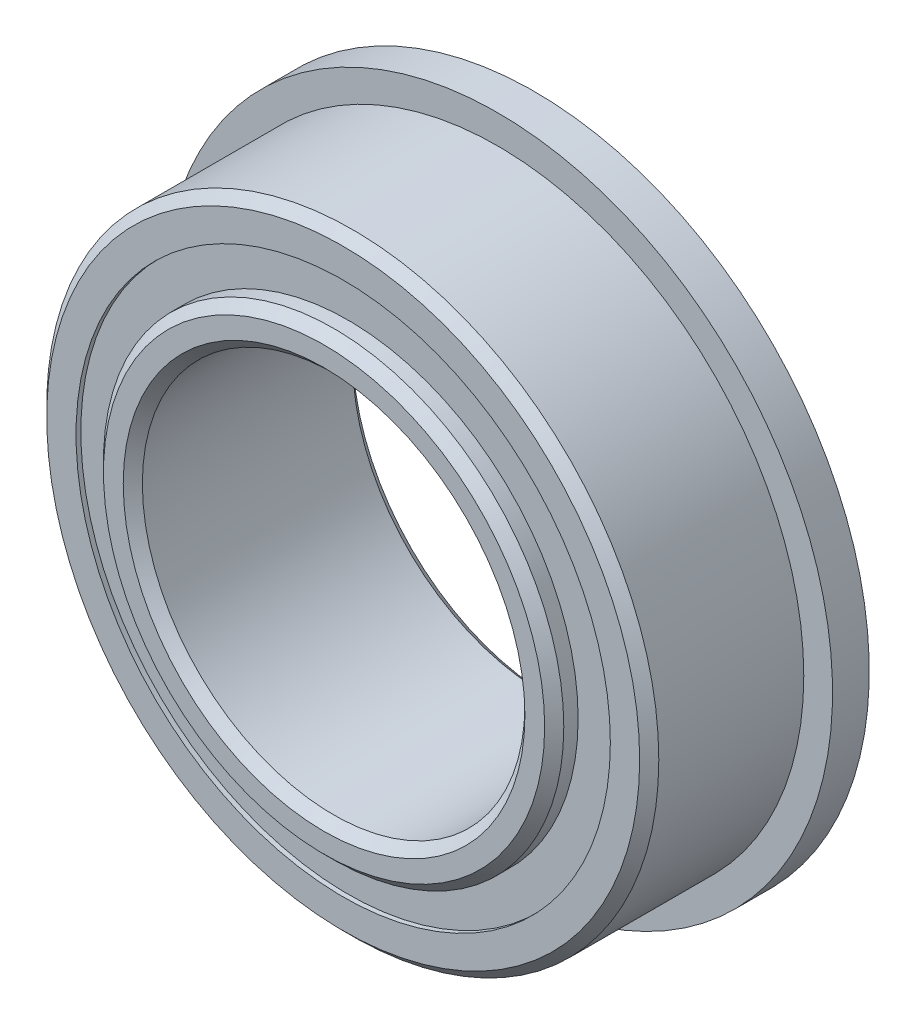
ISO-10303-21;
HEADER;
FILE_DESCRIPTION(('STEP AP214'),'2;1');
FILE_NAME('part.step','',(''),(''),'','','');
FILE_SCHEMA(('AUTOMOTIVE_DESIGN { 1 0 10303 214 1 1 1 1 }'));
ENDSEC;
DATA;
#1=APPLICATION_CONTEXT('core data for automotive mechanical design processes');
#2=APPLICATION_PROTOCOL_DEFINITION('international standard','automotive_design',2000,#1);
#3=PRODUCT_CONTEXT('',#1,'mechanical');
#4=PRODUCT('Part','Part','',(#3));
#5=PRODUCT_RELATED_PRODUCT_CATEGORY('part','',(#4));
#6=PRODUCT_DEFINITION_FORMATION('','',#4);
#7=PRODUCT_DEFINITION_CONTEXT('part definition',#1,'design');
#8=PRODUCT_DEFINITION('design','',#6,#7);
#9=PRODUCT_DEFINITION_SHAPE('','',#8);
#10=(LENGTH_UNIT() NAMED_UNIT(*) SI_UNIT(.MILLI.,.METRE.));
#11=(NAMED_UNIT(*) PLANE_ANGLE_UNIT() SI_UNIT($,.RADIAN.));
#12=(NAMED_UNIT(*) SI_UNIT($,.STERADIAN.) SOLID_ANGLE_UNIT());
#13=UNCERTAINTY_MEASURE_WITH_UNIT(LENGTH_MEASURE(1.E-05),#10,'distance_accuracy_value','');
#14=(GEOMETRIC_REPRESENTATION_CONTEXT(3) GLOBAL_UNCERTAINTY_ASSIGNED_CONTEXT((#13)) GLOBAL_UNIT_ASSIGNED_CONTEXT((#10,
#11,#12)) REPRESENTATION_CONTEXT('',''));
#15=CARTESIAN_POINT('',(0.,0.,0.));
#16=DIRECTION('',(0.,0.,1.));
#17=DIRECTION('',(1.,0.,0.));
#18=AXIS2_PLACEMENT_3D('',#15,#16,#17);
#19=CARTESIAN_POINT('',(0.,5.54316620879121,-1.88515625));
#20=DIRECTION('',(0.,0.,1.));
#21=DIRECTION('',(1.,0.,0.));
#22=AXIS2_PLACEMENT_3D('',#19,#20,#21);
#23=PLANE('',#22);
#24=CARTESIAN_POINT('',(0.,0.,-1.88515625));
#25=DIRECTION('',(0.,0.,1.));
#26=DIRECTION('',(1.,0.,0.));
#27=AXIS2_PLACEMENT_3D('',#24,#25,#26);
#28=CIRCLE('',#27,5.54316620879121);
#29=CARTESIAN_POINT('',(5.54316620879121,0.,-1.88515625));
#30=VERTEX_POINT('',#29);
#31=EDGE_CURVE('E55',#30,#30,#28,.T.);
#32=ORIENTED_EDGE('',*,*,#31,.F.);
#33=EDGE_LOOP('',(#32));
#34=FACE_BOUND('',#33,.T.);
#35=CARTESIAN_POINT('',(0.,0.,-1.88515625));
#36=DIRECTION('',(0.,0.,1.));
#37=DIRECTION('',(1.,0.,0.));
#38=AXIS2_PLACEMENT_3D('',#35,#36,#37);
#39=CIRCLE('',#38,4.77558379120879);
#40=CARTESIAN_POINT('',(4.77558379120879,0.,-1.88515625));
#41=VERTEX_POINT('',#40);
#42=EDGE_CURVE('E11',#41,#41,#39,.T.);
#43=ORIENTED_EDGE('',*,*,#42,.T.);
#44=EDGE_LOOP('',(#43));
#45=FACE_BOUND('',#44,.T.);
#46=ADVANCED_FACE('F41',(#34,#45),#23,.F.);
#47=CARTESIAN_POINT('',(0.,0.,1.984375));
#48=DIRECTION('',(0.,0.,1.));
#49=DIRECTION('',(1.,0.,0.));
#50=AXIS2_PLACEMENT_3D('',#47,#48,#49);
#51=CYLINDRICAL_SURFACE('',#50,4.77558379120879);
#52=ORIENTED_EDGE('',*,*,#42,.F.);
#53=EDGE_LOOP('',(#52));
#54=FACE_BOUND('',#53,.T.);
#55=CARTESIAN_POINT('',(0.,0.,-0.961832467237324));
#56=DIRECTION('',(0.,0.,1.));
#57=DIRECTION('',(1.,0.,0.));
#58=AXIS2_PLACEMENT_3D('',#55,#56,#57);
#59=CIRCLE('',#58,4.77558379120879);
#60=CARTESIAN_POINT('',(4.77558379120879,0.,-0.961832467237324));
#61=VERTEX_POINT('',#60);
#62=EDGE_CURVE('E47',#61,#61,#59,.T.);
#63=ORIENTED_EDGE('',*,*,#62,.T.);
#64=EDGE_LOOP('',(#63));
#65=FACE_BOUND('',#64,.T.);
#66=ADVANCED_FACE('F64',(#54,#65),#51,.F.);
#67=CARTESIAN_POINT('',(0.,5.54316620879121,-0.961832467237324));
#68=DIRECTION('',(0.,0.,-1.));
#69=DIRECTION('',(-1.,0.,0.));
#70=AXIS2_PLACEMENT_3D('',#67,#68,#69);
#71=PLANE('',#70);
#72=ORIENTED_EDGE('',*,*,#62,.F.);
#73=EDGE_LOOP('',(#72));
#74=FACE_BOUND('',#73,.T.);
#75=CARTESIAN_POINT('',(0.,0.,-0.961832467237324));
#76=DIRECTION('',(0.,0.,1.));
#77=DIRECTION('',(1.,0.,0.));
#78=AXIS2_PLACEMENT_3D('',#75,#76,#77);
#79=CIRCLE('',#78,5.54316620879121);
#80=CARTESIAN_POINT('',(5.54316620879121,0.,-0.961832467237324));
#81=VERTEX_POINT('',#80);
#82=EDGE_CURVE('E51',#81,#81,#79,.T.);
#83=ORIENTED_EDGE('',*,*,#82,.T.);
#84=EDGE_LOOP('',(#83));
#85=FACE_BOUND('',#84,.T.);
#86=ADVANCED_FACE('F68',(#74,#85),#71,.F.);
#87=CARTESIAN_POINT('',(0.,0.,1.984375));
#88=DIRECTION('',(0.,0.,1.));
#89=DIRECTION('',(1.,0.,0.));
#90=AXIS2_PLACEMENT_3D('',#87,#88,#89);
#91=CYLINDRICAL_SURFACE('',#90,5.54316620879121);
#92=ORIENTED_EDGE('',*,*,#82,.F.);
#93=EDGE_LOOP('',(#92));
#94=FACE_BOUND('',#93,.T.);
#95=ORIENTED_EDGE('',*,*,#31,.T.);
#96=EDGE_LOOP('',(#95));
#97=FACE_BOUND('',#96,.T.);
#98=ADVANCED_FACE('F61',(#94,#97),#91,.T.);
#99=CLOSED_SHELL('',(#46,#66,#86,#98));
#100=MANIFOLD_SOLID_BREP('B2',#99);
#101=CARTESIAN_POINT('',(0.,5.54316620879121,1.88515625));
#102=DIRECTION('',(0.,0.,-1.));
#103=DIRECTION('',(-1.,0.,0.));
#104=AXIS2_PLACEMENT_3D('',#101,#102,#103);
#105=PLANE('',#104);
#106=CARTESIAN_POINT('',(0.,0.,1.88515625));
#107=DIRECTION('',(0.,0.,1.));
#108=DIRECTION('',(1.,0.,0.));
#109=AXIS2_PLACEMENT_3D('',#106,#107,#108);
#110=CIRCLE('',#109,4.77558379120879);
#111=CARTESIAN_POINT('',(4.77558379120879,0.,1.88515625));
#112=VERTEX_POINT('',#111);
#113=EDGE_CURVE('E40',#112,#112,#110,.T.);
#114=ORIENTED_EDGE('',*,*,#113,.F.);
#115=EDGE_LOOP('',(#114));
#116=FACE_BOUND('',#115,.T.);
#117=CARTESIAN_POINT('',(0.,0.,1.88515625));
#118=DIRECTION('',(0.,0.,1.));
#119=DIRECTION('',(1.,0.,0.));
#120=AXIS2_PLACEMENT_3D('',#117,#118,#119);
#121=CIRCLE('',#120,5.54316620879121);
#122=CARTESIAN_POINT('',(5.54316620879121,0.,1.88515625));
#123=VERTEX_POINT('',#122);
#124=EDGE_CURVE('E122',#123,#123,#121,.T.);
#125=ORIENTED_EDGE('',*,*,#124,.T.);
#126=EDGE_LOOP('',(#125));
#127=FACE_BOUND('',#126,.T.);
#128=ADVANCED_FACE('F108',(#116,#127),#105,.F.);
#129=CARTESIAN_POINT('',(0.,0.,1.984375));
#130=DIRECTION('',(0.,0.,1.));
#131=DIRECTION('',(1.,0.,0.));
#132=AXIS2_PLACEMENT_3D('',#129,#130,#131);
#133=CYLINDRICAL_SURFACE('',#132,4.77558379120879);
#134=CARTESIAN_POINT('',(0.,0.,0.961832467237323));
#135=DIRECTION('',(0.,0.,1.));
#136=DIRECTION('',(1.,0.,0.));
#137=AXIS2_PLACEMENT_3D('',#134,#135,#136);
#138=CIRCLE('',#137,4.77558379120879);
#139=CARTESIAN_POINT('',(4.77558379120879,0.,0.961832467237323));
#140=VERTEX_POINT('',#139);
#141=EDGE_CURVE('E114',#140,#140,#138,.T.);
#142=ORIENTED_EDGE('',*,*,#141,.F.);
#143=EDGE_LOOP('',(#142));
#144=FACE_BOUND('',#143,.T.);
#145=ORIENTED_EDGE('',*,*,#113,.T.);
#146=EDGE_LOOP('',(#145));
#147=FACE_BOUND('',#146,.T.);
#148=ADVANCED_FACE('F137',(#144,#147),#133,.F.);
#149=CARTESIAN_POINT('',(0.,5.54316620879121,0.961832467237323));
#150=DIRECTION('',(0.,0.,1.));
#151=DIRECTION('',(1.,0.,0.));
#152=AXIS2_PLACEMENT_3D('',#149,#150,#151);
#153=PLANE('',#152);
#154=CARTESIAN_POINT('',(0.,0.,0.961832467237323));
#155=DIRECTION('',(0.,0.,1.));
#156=DIRECTION('',(1.,0.,0.));
#157=AXIS2_PLACEMENT_3D('',#154,#155,#156);
#158=CIRCLE('',#157,5.54316620879121);
#159=CARTESIAN_POINT('',(5.54316620879121,0.,0.961832467237323));
#160=VERTEX_POINT('',#159);
#161=EDGE_CURVE('E118',#160,#160,#158,.T.);
#162=ORIENTED_EDGE('',*,*,#161,.F.);
#163=EDGE_LOOP('',(#162));
#164=FACE_BOUND('',#163,.T.);
#165=ORIENTED_EDGE('',*,*,#141,.T.);
#166=EDGE_LOOP('',(#165));
#167=FACE_BOUND('',#166,.T.);
#168=ADVANCED_FACE('F132',(#164,#167),#153,.F.);
#169=CARTESIAN_POINT('',(0.,0.,1.984375));
#170=DIRECTION('',(0.,0.,1.));
#171=DIRECTION('',(1.,0.,0.));
#172=AXIS2_PLACEMENT_3D('',#169,#170,#171);
#173=CYLINDRICAL_SURFACE('',#172,5.54316620879121);
#174=ORIENTED_EDGE('',*,*,#124,.F.);
#175=EDGE_LOOP('',(#174));
#176=FACE_BOUND('',#175,.T.);
#177=ORIENTED_EDGE('',*,*,#161,.T.);
#178=EDGE_LOOP('',(#177));
#179=FACE_BOUND('',#178,.T.);
#180=ADVANCED_FACE('F129',(#176,#179),#173,.T.);
#181=CLOSED_SHELL('',(#128,#148,#168,#180));
#182=MANIFOLD_SOLID_BREP('B6',#181);
#183=CARTESIAN_POINT('',(-2.57968749999994,4.46814981765037,0.));
#184=DIRECTION('',(0.,0.,1.));
#185=DIRECTION('',(0.499999999999989,-0.866025403784445,0.));
#186=AXIS2_PLACEMENT_3D('',#183,#184,#185);
#187=SPHERICAL_SURFACE('',#186,0.961832467237323);
#188=CARTESIAN_POINT('',(-2.57968749999994,4.46814981765037,0.961832467237323));
#189=VERTEX_POINT('',#188);
#190=VERTEX_LOOP('',#189);
#191=FACE_BOUND('',#190,.T.);
#192=ADVANCED_FACE('F175',(#191),#187,.T.);
#193=CLOSED_SHELL('',(#192));
#194=MANIFOLD_SOLID_BREP('B35',#193);
#195=CARTESIAN_POINT('',(-4.46814981765031,2.57968750000005,0.));
#196=DIRECTION('',(0.,0.,1.));
#197=DIRECTION('',(0.866025403784433,-0.50000000000001,0.));
#198=AXIS2_PLACEMENT_3D('',#195,#196,#197);
#199=SPHERICAL_SURFACE('',#198,0.961832467237323);
#200=CARTESIAN_POINT('',(-4.46814981765031,2.57968750000005,0.961832467237323));
#201=VERTEX_POINT('',#200);
#202=VERTEX_LOOP('',#201);
#203=FACE_BOUND('',#202,.T.);
#204=ADVANCED_FACE('F195',(#203),#199,.T.);
#205=CLOSED_SHELL('',(#204));
#206=MANIFOLD_SOLID_BREP('B104',#205);
#207=CARTESIAN_POINT('',(-5.159375,0.,0.));
#208=DIRECTION('',(0.,0.,1.));
#209=DIRECTION('',(1.,0.,0.));
#210=AXIS2_PLACEMENT_3D('',#207,#208,#209);
#211=SPHERICAL_SURFACE('',#210,0.961832467237323);
#212=CARTESIAN_POINT('',(-5.159375,0.,0.961832467237323));
#213=VERTEX_POINT('',#212);
#214=VERTEX_LOOP('',#213);
#215=FACE_BOUND('',#214,.T.);
#216=ADVANCED_FACE('F215',(#215),#211,.T.);
#217=CLOSED_SHELL('',(#216));
#218=MANIFOLD_SOLID_BREP('B171',#217);
#219=CARTESIAN_POINT('',(-4.46814981765036,-2.57968749999996,0.));
#220=DIRECTION('',(0.,0.,1.));
#221=DIRECTION('',(0.866025403784443,0.499999999999992,0.));
#222=AXIS2_PLACEMENT_3D('',#219,#220,#221);
#223=SPHERICAL_SURFACE('',#222,0.961832467237323);
#224=CARTESIAN_POINT('',(-4.46814981765036,-2.57968749999996,0.961832467237323));
#225=VERTEX_POINT('',#224);
#226=VERTEX_LOOP('',#225);
#227=FACE_BOUND('',#226,.T.);
#228=ADVANCED_FACE('F235',(#227),#223,.T.);
#229=CLOSED_SHELL('',(#228));
#230=MANIFOLD_SOLID_BREP('B191',#229);
#231=CARTESIAN_POINT('',(-2.57968750000004,-4.46814981765032,0.));
#232=DIRECTION('',(0.,0.,1.));
#233=DIRECTION('',(0.500000000000007,0.866025403784435,0.));
#234=AXIS2_PLACEMENT_3D('',#231,#232,#233);
#235=SPHERICAL_SURFACE('',#234,0.961832467237323);
#236=CARTESIAN_POINT('',(-2.57968750000004,-4.46814981765032,0.961832467237323));
#237=VERTEX_POINT('',#236);
#238=VERTEX_LOOP('',#237);
#239=FACE_BOUND('',#238,.T.);
#240=ADVANCED_FACE('F255',(#239),#235,.T.);
#241=CLOSED_SHELL('',(#240));
#242=MANIFOLD_SOLID_BREP('B211',#241);
#243=CARTESIAN_POINT('',(0.,-5.159375,0.));
#244=DIRECTION('',(0.,0.,1.));
#245=DIRECTION('',(0.,1.,0.));
#246=AXIS2_PLACEMENT_3D('',#243,#244,#245);
#247=SPHERICAL_SURFACE('',#246,0.961832467237323);
#248=CARTESIAN_POINT('',(0.,-5.159375,0.961832467237323));
#249=VERTEX_POINT('',#248);
#250=VERTEX_LOOP('',#249);
#251=FACE_BOUND('',#250,.T.);
#252=ADVANCED_FACE('F275',(#251),#247,.T.);
#253=CLOSED_SHELL('',(#252));
#254=MANIFOLD_SOLID_BREP('B231',#253);
#255=CARTESIAN_POINT('',(2.57968749999997,-4.46814981765035,0.));
#256=DIRECTION('',(0.,0.,1.));
#257=DIRECTION('',(-0.499999999999995,0.866025403784442,0.));
#258=AXIS2_PLACEMENT_3D('',#255,#256,#257);
#259=SPHERICAL_SURFACE('',#258,0.961832467237323);
#260=CARTESIAN_POINT('',(2.57968749999997,-4.46814981765035,0.961832467237323));
#261=VERTEX_POINT('',#260);
#262=VERTEX_LOOP('',#261);
#263=FACE_BOUND('',#262,.T.);
#264=ADVANCED_FACE('F295',(#263),#259,.T.);
#265=CLOSED_SHELL('',(#264));
#266=MANIFOLD_SOLID_BREP('B251',#265);
#267=CARTESIAN_POINT('',(4.46814981765033,-2.57968750000002,0.));
#268=DIRECTION('',(0.,0.,1.));
#269=DIRECTION('',(-0.866025403784436,0.500000000000004,0.));
#270=AXIS2_PLACEMENT_3D('',#267,#268,#269);
#271=SPHERICAL_SURFACE('',#270,0.961832467237323);
#272=CARTESIAN_POINT('',(4.46814981765033,-2.57968750000002,0.961832467237323));
#273=VERTEX_POINT('',#272);
#274=VERTEX_LOOP('',#273);
#275=FACE_BOUND('',#274,.T.);
#276=ADVANCED_FACE('F315',(#275),#271,.T.);
#277=CLOSED_SHELL('',(#276));
#278=MANIFOLD_SOLID_BREP('B271',#277);
#279=CARTESIAN_POINT('',(5.159375,0.,0.));
#280=DIRECTION('',(0.,0.,1.));
#281=DIRECTION('',(-1.,0.,0.));
#282=AXIS2_PLACEMENT_3D('',#279,#280,#281);
#283=SPHERICAL_SURFACE('',#282,0.961832467237323);
#284=CARTESIAN_POINT('',(5.159375,0.,0.961832467237323));
#285=VERTEX_POINT('',#284);
#286=VERTEX_LOOP('',#285);
#287=FACE_BOUND('',#286,.T.);
#288=ADVANCED_FACE('F335',(#287),#283,.T.);
#289=CLOSED_SHELL('',(#288));
#290=MANIFOLD_SOLID_BREP('B291',#289);
#291=CARTESIAN_POINT('',(4.46814981765034,2.57968749999999,0.));
#292=DIRECTION('',(0.,0.,1.));
#293=DIRECTION('',(-0.86602540378444,-0.499999999999998,0.));
#294=AXIS2_PLACEMENT_3D('',#291,#292,#293);
#295=SPHERICAL_SURFACE('',#294,0.961832467237323);
#296=CARTESIAN_POINT('',(4.46814981765034,2.57968749999999,0.961832467237323));
#297=VERTEX_POINT('',#296);
#298=VERTEX_LOOP('',#297);
#299=FACE_BOUND('',#298,.T.);
#300=ADVANCED_FACE('F355',(#299),#295,.T.);
#301=CLOSED_SHELL('',(#300));
#302=MANIFOLD_SOLID_BREP('B311',#301);
#303=CARTESIAN_POINT('',(2.57968750000001,4.46814981765033,0.));
#304=DIRECTION('',(0.,0.,1.));
#305=DIRECTION('',(-0.500000000000001,-0.866025403784438,0.));
#306=AXIS2_PLACEMENT_3D('',#303,#304,#305);
#307=SPHERICAL_SURFACE('',#306,0.961832467237323);
#308=CARTESIAN_POINT('',(2.57968750000001,4.46814981765033,0.961832467237323));
#309=VERTEX_POINT('',#308);
#310=VERTEX_LOOP('',#309);
#311=FACE_BOUND('',#310,.T.);
#312=ADVANCED_FACE('F375',(#311),#307,.T.);
#313=CLOSED_SHELL('',(#312));
#314=MANIFOLD_SOLID_BREP('B331',#313);
#315=CARTESIAN_POINT('',(0.,5.159375,0.));
#316=DIRECTION('',(0.,0.,1.));
#317=DIRECTION('',(0.,-1.,0.));
#318=AXIS2_PLACEMENT_3D('',#315,#316,#317);
#319=SPHERICAL_SURFACE('',#318,0.961832467237323);
#320=CARTESIAN_POINT('',(0.,5.159375,0.961832467237323));
#321=VERTEX_POINT('',#320);
#322=VERTEX_LOOP('',#321);
#323=FACE_BOUND('',#322,.T.);
#324=ADVANCED_FACE('F397',(#323),#319,.T.);
#325=CLOSED_SHELL('',(#324));
#326=MANIFOLD_SOLID_BREP('B351',#325);
#327=CARTESIAN_POINT('',(0.,0.,2.1828125));
#328=DIRECTION('',(0.,0.,-1.));
#329=DIRECTION('',(-1.,0.,0.));
#330=AXIS2_PLACEMENT_3D('',#327,#328,#329);
#331=CONICAL_SURFACE('',#330,4.77558379120879,0.785398163397445);
#332=CARTESIAN_POINT('',(0.,0.,2.38125));
#333=DIRECTION('',(0.,0.,1.));
#334=DIRECTION('',(1.,0.,0.));
#335=AXIS2_PLACEMENT_3D('',#332,#333,#334);
#336=CIRCLE('',#335,4.57714629120879);
#337=CARTESIAN_POINT('',(4.57714629120879,0.,2.38125));
#338=VERTEX_POINT('',#337);
#339=EDGE_CURVE('E450',#338,#338,#336,.T.);
#340=ORIENTED_EDGE('',*,*,#339,.F.);
#341=EDGE_LOOP('',(#340));
#342=FACE_BOUND('',#341,.T.);
#343=CARTESIAN_POINT('',(0.,0.,2.1828125));
#344=DIRECTION('',(0.,0.,1.));
#345=DIRECTION('',(1.,0.,0.));
#346=AXIS2_PLACEMENT_3D('',#343,#344,#345);
#347=CIRCLE('',#346,4.77558379120879);
#348=CARTESIAN_POINT('',(4.77558379120879,0.,2.1828125));
#349=VERTEX_POINT('',#348);
#350=EDGE_CURVE('E396',#349,#349,#347,.T.);
#351=ORIENTED_EDGE('',*,*,#350,.T.);
#352=EDGE_LOOP('',(#351));
#353=FACE_BOUND('',#352,.T.);
#354=ADVANCED_FACE('F416',(#342,#353),#331,.T.);
#355=CARTESIAN_POINT('',(0.,0.,1.984375));
#356=DIRECTION('',(0.,0.,1.));
#357=DIRECTION('',(1.,0.,0.));
#358=AXIS2_PLACEMENT_3D('',#355,#356,#357);
#359=CYLINDRICAL_SURFACE('',#358,4.77558379120879);
#360=ORIENTED_EDGE('',*,*,#350,.F.);
#361=EDGE_LOOP('',(#360));
#362=FACE_BOUND('',#361,.T.);
#363=CARTESIAN_POINT('',(0.,0.,0.881944444444443));
#364=DIRECTION('',(0.,0.,1.));
#365=DIRECTION('',(1.,0.,0.));
#366=AXIS2_PLACEMENT_3D('',#363,#364,#365);
#367=CIRCLE('',#366,4.77558379120879);
#368=CARTESIAN_POINT('',(4.77558379120879,0.,0.881944444444443));
#369=VERTEX_POINT('',#368);
#370=EDGE_CURVE('E422',#369,#369,#367,.T.);
#371=ORIENTED_EDGE('',*,*,#370,.T.);
#372=EDGE_LOOP('',(#371));
#373=FACE_BOUND('',#372,.T.);
#374=ADVANCED_FACE('F457',(#362,#373),#359,.T.);
#375=CARTESIAN_POINT('',(0.,0.,0.));
#376=DIRECTION('',(0.,0.,1.));
#377=DIRECTION('',(1.,0.,0.));
#378=AXIS2_PLACEMENT_3D('',#375,#376,#377);
#379=TOROIDAL_SURFACE('',#378,5.159375,0.961832467237322);
#380=ORIENTED_EDGE('',*,*,#370,.F.);
#381=EDGE_LOOP('',(#380));
#382=FACE_BOUND('',#381,.T.);
#383=CARTESIAN_POINT('',(0.,0.,-0.881944444444445));
#384=DIRECTION('',(0.,0.,1.));
#385=DIRECTION('',(1.,0.,0.));
#386=AXIS2_PLACEMENT_3D('',#383,#384,#385);
#387=CIRCLE('',#386,4.77558379120879);
#388=CARTESIAN_POINT('',(4.77558379120879,0.,-0.881944444444445));
#389=VERTEX_POINT('',#388);
#390=EDGE_CURVE('E426',#389,#389,#387,.T.);
#391=ORIENTED_EDGE('',*,*,#390,.T.);
#392=EDGE_LOOP('',(#391));
#393=FACE_BOUND('',#392,.T.);
#394=ADVANCED_FACE('F461',(#382,#393),#379,.F.);
#395=CARTESIAN_POINT('',(0.,0.,1.984375));
#396=DIRECTION('',(0.,0.,1.));
#397=DIRECTION('',(1.,0.,0.));
#398=AXIS2_PLACEMENT_3D('',#395,#396,#397);
#399=CYLINDRICAL_SURFACE('',#398,4.77558379120879);
#400=ORIENTED_EDGE('',*,*,#390,.F.);
#401=EDGE_LOOP('',(#400));
#402=FACE_BOUND('',#401,.T.);
#403=CARTESIAN_POINT('',(0.,0.,-2.1828125));
#404=DIRECTION('',(0.,0.,1.));
#405=DIRECTION('',(1.,0.,0.));
#406=AXIS2_PLACEMENT_3D('',#403,#404,#405);
#407=CIRCLE('',#406,4.77558379120879);
#408=CARTESIAN_POINT('',(4.77558379120879,0.,-2.1828125));
#409=VERTEX_POINT('',#408);
#410=EDGE_CURVE('E430',#409,#409,#407,.T.);
#411=ORIENTED_EDGE('',*,*,#410,.T.);
#412=EDGE_LOOP('',(#411));
#413=FACE_BOUND('',#412,.T.);
#414=ADVANCED_FACE('F466',(#402,#413),#399,.T.);
#415=CARTESIAN_POINT('',(0.,0.,-2.38125));
#416=DIRECTION('',(0.,0.,1.));
#417=DIRECTION('',(1.,0.,0.));
#418=AXIS2_PLACEMENT_3D('',#415,#416,#417);
#419=CONICAL_SURFACE('',#418,4.57714629120879,0.785398163397448);
#420=ORIENTED_EDGE('',*,*,#410,.F.);
#421=EDGE_LOOP('',(#420));
#422=FACE_BOUND('',#421,.T.);
#423=CARTESIAN_POINT('',(0.,0.,-2.38125));
#424=DIRECTION('',(0.,0.,1.));
#425=DIRECTION('',(1.,0.,0.));
#426=AXIS2_PLACEMENT_3D('',#423,#424,#425);
#427=CIRCLE('',#426,4.57714629120879);
#428=CARTESIAN_POINT('',(4.57714629120879,0.,-2.38125));
#429=VERTEX_POINT('',#428);
#430=EDGE_CURVE('E435',#429,#429,#427,.T.);
#431=ORIENTED_EDGE('',*,*,#430,.T.);
#432=EDGE_LOOP('',(#431));
#433=FACE_BOUND('',#432,.T.);
#434=ADVANCED_FACE('F472',(#422,#433),#419,.T.);
#435=CARTESIAN_POINT('',(0.,4.57714629120879,-2.38125));
#436=DIRECTION('',(0.,0.,1.));
#437=DIRECTION('',(1.,0.,0.));
#438=AXIS2_PLACEMENT_3D('',#435,#436,#437);
#439=PLANE('',#438);
#440=ORIENTED_EDGE('',*,*,#430,.F.);
#441=EDGE_LOOP('',(#440));
#442=FACE_BOUND('',#441,.T.);
#443=CARTESIAN_POINT('',(0.,0.,-2.38125));
#444=DIRECTION('',(0.,0.,1.));
#445=DIRECTION('',(1.,0.,0.));
#446=AXIS2_PLACEMENT_3D('',#443,#444,#445);
#447=CIRCLE('',#446,4.1671875);
#448=CARTESIAN_POINT('',(4.1671875,0.,-2.38125));
#449=VERTEX_POINT('',#448);
#450=EDGE_CURVE('E438',#449,#449,#447,.T.);
#451=ORIENTED_EDGE('',*,*,#450,.T.);
#452=EDGE_LOOP('',(#451));
#453=FACE_BOUND('',#452,.T.);
#454=ADVANCED_FACE('F476',(#442,#453),#439,.F.);
#455=CARTESIAN_POINT('',(0.,0.,-2.1828125));
#456=DIRECTION('',(0.,0.,-1.));
#457=DIRECTION('',(-1.,0.,0.));
#458=AXIS2_PLACEMENT_3D('',#455,#456,#457);
#459=CONICAL_SURFACE('',#458,3.96875,0.785398163397448);
#460=ORIENTED_EDGE('',*,*,#450,.F.);
#461=EDGE_LOOP('',(#460));
#462=FACE_BOUND('',#461,.T.);
#463=CARTESIAN_POINT('',(0.,0.,-2.1828125));
#464=DIRECTION('',(0.,0.,1.));
#465=DIRECTION('',(1.,0.,0.));
#466=AXIS2_PLACEMENT_3D('',#463,#464,#465);
#467=CIRCLE('',#466,3.96875);
#468=CARTESIAN_POINT('',(3.96875,0.,-2.1828125));
#469=VERTEX_POINT('',#468);
#470=EDGE_CURVE('E441',#469,#469,#467,.T.);
#471=ORIENTED_EDGE('',*,*,#470,.T.);
#472=EDGE_LOOP('',(#471));
#473=FACE_BOUND('',#472,.T.);
#474=ADVANCED_FACE('F480',(#462,#473),#459,.F.);
#475=CARTESIAN_POINT('',(0.,0.,1.984375));
#476=DIRECTION('',(0.,0.,1.));
#477=DIRECTION('',(1.,0.,0.));
#478=AXIS2_PLACEMENT_3D('',#475,#476,#477);
#479=CYLINDRICAL_SURFACE('',#478,3.96875);
#480=ORIENTED_EDGE('',*,*,#470,.F.);
#481=EDGE_LOOP('',(#480));
#482=FACE_BOUND('',#481,.T.);
#483=CARTESIAN_POINT('',(0.,0.,2.1828125));
#484=DIRECTION('',(0.,0.,1.));
#485=DIRECTION('',(1.,0.,0.));
#486=AXIS2_PLACEMENT_3D('',#483,#484,#485);
#487=CIRCLE('',#486,3.96875);
#488=CARTESIAN_POINT('',(3.96875,0.,2.1828125));
#489=VERTEX_POINT('',#488);
#490=EDGE_CURVE('E444',#489,#489,#487,.T.);
#491=ORIENTED_EDGE('',*,*,#490,.T.);
#492=EDGE_LOOP('',(#491));
#493=FACE_BOUND('',#492,.T.);
#494=ADVANCED_FACE('F484',(#482,#493),#479,.F.);
#495=CARTESIAN_POINT('',(0.,0.,2.38125));
#496=DIRECTION('',(0.,0.,1.));
#497=DIRECTION('',(1.,0.,0.));
#498=AXIS2_PLACEMENT_3D('',#495,#496,#497);
#499=CONICAL_SURFACE('',#498,4.1671875,0.78539816339745);
#500=ORIENTED_EDGE('',*,*,#490,.F.);
#501=EDGE_LOOP('',(#500));
#502=FACE_BOUND('',#501,.T.);
#503=CARTESIAN_POINT('',(0.,0.,2.38125));
#504=DIRECTION('',(0.,0.,1.));
#505=DIRECTION('',(1.,0.,0.));
#506=AXIS2_PLACEMENT_3D('',#503,#504,#505);
#507=CIRCLE('',#506,4.1671875);
#508=CARTESIAN_POINT('',(4.1671875,0.,2.38125));
#509=VERTEX_POINT('',#508);
#510=EDGE_CURVE('E447',#509,#509,#507,.T.);
#511=ORIENTED_EDGE('',*,*,#510,.T.);
#512=EDGE_LOOP('',(#511));
#513=FACE_BOUND('',#512,.T.);
#514=ADVANCED_FACE('F488',(#502,#513),#499,.F.);
#515=CARTESIAN_POINT('',(0.,4.1671875,2.38125));
#516=DIRECTION('',(0.,0.,-1.));
#517=DIRECTION('',(-1.,0.,0.));
#518=AXIS2_PLACEMENT_3D('',#515,#516,#517);
#519=PLANE('',#518);
#520=ORIENTED_EDGE('',*,*,#510,.F.);
#521=EDGE_LOOP('',(#520));
#522=FACE_BOUND('',#521,.T.);
#523=ORIENTED_EDGE('',*,*,#339,.T.);
#524=EDGE_LOOP('',(#523));
#525=FACE_BOUND('',#524,.T.);
#526=ADVANCED_FACE('F454',(#522,#525),#519,.F.);
#527=CLOSED_SHELL('',(#354,#374,#394,#414,#434,#454,#474,#494,#514,#526));
#528=MANIFOLD_SOLID_BREP('B371',#527);
#529=CARTESIAN_POINT('',(0.,0.,1.7859375));
#530=DIRECTION('',(0.,0.,-1.));
#531=DIRECTION('',(-1.,0.,0.));
#532=AXIS2_PLACEMENT_3D('',#529,#530,#531);
#533=CONICAL_SURFACE('',#532,6.35,0.785398163397443);
#534=CARTESIAN_POINT('',(0.,0.,1.984375));
#535=DIRECTION('',(0.,0.,1.));
#536=DIRECTION('',(1.,0.,0.));
#537=AXIS2_PLACEMENT_3D('',#534,#535,#536);
#538=CIRCLE('',#537,6.1515625);
#539=CARTESIAN_POINT('',(6.1515625,0.,1.984375));
#540=VERTEX_POINT('',#539);
#541=EDGE_CURVE('E589',#540,#540,#538,.T.);
#542=ORIENTED_EDGE('',*,*,#541,.F.);
#543=EDGE_LOOP('',(#542));
#544=FACE_BOUND('',#543,.T.);
#545=CARTESIAN_POINT('',(0.,0.,1.7859375));
#546=DIRECTION('',(0.,0.,1.));
#547=DIRECTION('',(1.,0.,0.));
#548=AXIS2_PLACEMENT_3D('',#545,#546,#547);
#549=CIRCLE('',#548,6.35);
#550=CARTESIAN_POINT('',(6.35,0.,1.7859375));
#551=VERTEX_POINT('',#550);
#552=EDGE_CURVE('E415',#551,#551,#549,.T.);
#553=ORIENTED_EDGE('',*,*,#552,.T.);
#554=EDGE_LOOP('',(#553));
#555=FACE_BOUND('',#554,.T.);
#556=ADVANCED_FACE('F567',(#544,#555),#533,.T.);
#557=CARTESIAN_POINT('',(0.,0.,1.984375));
#558=DIRECTION('',(0.,0.,1.));
#559=DIRECTION('',(1.,0.,0.));
#560=AXIS2_PLACEMENT_3D('',#557,#558,#559);
#561=CYLINDRICAL_SURFACE('',#560,6.35);
#562=CARTESIAN_POINT('',(0.,0.,-1.222375));
#563=DIRECTION('',(0.,0.,1.));
#564=DIRECTION('',(1.,0.,0.));
#565=AXIS2_PLACEMENT_3D('',#562,#563,#564);
#566=CIRCLE('',#565,6.35);
#567=CARTESIAN_POINT('',(6.35,0.,-1.222375));
#568=VERTEX_POINT('',#567);
#569=EDGE_CURVE('E592',#568,#568,#566,.T.);
#570=ORIENTED_EDGE('',*,*,#569,.T.);
#571=EDGE_LOOP('',(#570));
#572=FACE_BOUND('',#571,.T.);
#573=ORIENTED_EDGE('',*,*,#552,.F.);
#574=EDGE_LOOP('',(#573));
#575=FACE_BOUND('',#574,.T.);
#576=ADVANCED_FACE('F612',(#572,#575),#561,.T.);
#577=CARTESIAN_POINT('',(0.,6.1515625,-1.984375));
#578=DIRECTION('',(0.,0.,1.));
#579=DIRECTION('',(1.,0.,0.));
#580=AXIS2_PLACEMENT_3D('',#577,#578,#579);
#581=PLANE('',#580);
#582=CARTESIAN_POINT('',(0.,0.,-1.984375));
#583=DIRECTION('',(0.,0.,1.));
#584=DIRECTION('',(1.,0.,0.));
#585=AXIS2_PLACEMENT_3D('',#582,#583,#584);
#586=CIRCLE('',#585,5.54316620879121);
#587=CARTESIAN_POINT('',(5.54316620879121,0.,-1.984375));
#588=VERTEX_POINT('',#587);
#589=EDGE_CURVE('E573',#588,#588,#586,.T.);
#590=ORIENTED_EDGE('',*,*,#589,.T.);
#591=EDGE_LOOP('',(#590));
#592=FACE_BOUND('',#591,.T.);
#593=CARTESIAN_POINT('',(0.,0.,-1.984375));
#594=DIRECTION('',(0.,0.,-1.));
#595=DIRECTION('',(-1.,0.,0.));
#596=AXIS2_PLACEMENT_3D('',#593,#594,#595);
#597=CIRCLE('',#596,6.9469);
#598=CARTESIAN_POINT('',(-6.9469,0.,-1.984375));
#599=VERTEX_POINT('',#598);
#600=EDGE_CURVE('E595',#599,#599,#597,.T.);
#601=ORIENTED_EDGE('',*,*,#600,.T.);
#602=EDGE_LOOP('',(#601));
#603=FACE_BOUND('',#602,.T.);
#604=ADVANCED_FACE('F615',(#592,#603),#581,.F.);
#605=CARTESIAN_POINT('',(0.,0.,1.984375));
#606=DIRECTION('',(0.,0.,1.));
#607=DIRECTION('',(1.,0.,0.));
#608=AXIS2_PLACEMENT_3D('',#605,#606,#607);
#609=CYLINDRICAL_SURFACE('',#608,5.54316620879121);
#610=CARTESIAN_POINT('',(0.,0.,-0.881944444444445));
#611=DIRECTION('',(0.,0.,1.));
#612=DIRECTION('',(1.,0.,0.));
#613=AXIS2_PLACEMENT_3D('',#610,#611,#612);
#614=CIRCLE('',#613,5.54316620879121);
#615=CARTESIAN_POINT('',(5.54316620879121,0.,-0.881944444444445));
#616=VERTEX_POINT('',#615);
#617=EDGE_CURVE('E577',#616,#616,#614,.T.);
#618=ORIENTED_EDGE('',*,*,#617,.T.);
#619=EDGE_LOOP('',(#618));
#620=FACE_BOUND('',#619,.T.);
#621=ORIENTED_EDGE('',*,*,#589,.F.);
#622=EDGE_LOOP('',(#621));
#623=FACE_BOUND('',#622,.T.);
#624=ADVANCED_FACE('F620',(#620,#623),#609,.F.);
#625=CARTESIAN_POINT('',(0.,0.,0.));
#626=DIRECTION('',(0.,0.,1.));
#627=DIRECTION('',(1.,0.,0.));
#628=AXIS2_PLACEMENT_3D('',#625,#626,#627);
#629=TOROIDAL_SURFACE('',#628,5.159375,0.961832467237323);
#630=ORIENTED_EDGE('',*,*,#617,.F.);
#631=EDGE_LOOP('',(#630));
#632=FACE_BOUND('',#631,.T.);
#633=CARTESIAN_POINT('',(0.,0.,0.881944444444444));
#634=DIRECTION('',(0.,0.,1.));
#635=DIRECTION('',(1.,0.,0.));
#636=AXIS2_PLACEMENT_3D('',#633,#634,#635);
#637=CIRCLE('',#636,5.54316620879121);
#638=CARTESIAN_POINT('',(5.54316620879121,0.,0.881944444444444));
#639=VERTEX_POINT('',#638);
#640=EDGE_CURVE('E581',#639,#639,#637,.T.);
#641=ORIENTED_EDGE('',*,*,#640,.T.);
#642=EDGE_LOOP('',(#641));
#643=FACE_BOUND('',#642,.T.);
#644=ADVANCED_FACE('F626',(#632,#643),#629,.F.);
#645=CARTESIAN_POINT('',(0.,0.,1.984375));
#646=DIRECTION('',(0.,0.,1.));
#647=DIRECTION('',(1.,0.,0.));
#648=AXIS2_PLACEMENT_3D('',#645,#646,#647);
#649=CYLINDRICAL_SURFACE('',#648,5.54316620879121);
#650=ORIENTED_EDGE('',*,*,#640,.F.);
#651=EDGE_LOOP('',(#650));
#652=FACE_BOUND('',#651,.T.);
#653=CARTESIAN_POINT('',(0.,0.,1.984375));
#654=DIRECTION('',(0.,0.,1.));
#655=DIRECTION('',(1.,0.,0.));
#656=AXIS2_PLACEMENT_3D('',#653,#654,#655);
#657=CIRCLE('',#656,5.54316620879121);
#658=CARTESIAN_POINT('',(5.54316620879121,0.,1.984375));
#659=VERTEX_POINT('',#658);
#660=EDGE_CURVE('E586',#659,#659,#657,.T.);
#661=ORIENTED_EDGE('',*,*,#660,.T.);
#662=EDGE_LOOP('',(#661));
#663=FACE_BOUND('',#662,.T.);
#664=ADVANCED_FACE('F630',(#652,#663),#649,.F.);
#665=CARTESIAN_POINT('',(0.,6.1515625,1.984375));
#666=DIRECTION('',(0.,0.,-1.));
#667=DIRECTION('',(-1.,0.,0.));
#668=AXIS2_PLACEMENT_3D('',#665,#666,#667);
#669=PLANE('',#668);
#670=ORIENTED_EDGE('',*,*,#660,.F.);
#671=EDGE_LOOP('',(#670));
#672=FACE_BOUND('',#671,.T.);
#673=ORIENTED_EDGE('',*,*,#541,.T.);
#674=EDGE_LOOP('',(#673));
#675=FACE_BOUND('',#674,.T.);
#676=ADVANCED_FACE('F608',(#672,#675),#669,.F.);
#677=CARTESIAN_POINT('',(0.,5.54316620879121,-1.222375));
#678=DIRECTION('',(0.,0.,1.));
#679=DIRECTION('',(1.,0.,0.));
#680=AXIS2_PLACEMENT_3D('',#677,#678,#679);
#681=PLANE('',#680);
#682=CARTESIAN_POINT('',(0.,0.,-1.222375));
#683=DIRECTION('',(0.,0.,-1.));
#684=DIRECTION('',(-1.,0.,0.));
#685=AXIS2_PLACEMENT_3D('',#682,#683,#684);
#686=CIRCLE('',#685,6.9469);
#687=CARTESIAN_POINT('',(-6.9469,0.,-1.222375));
#688=VERTEX_POINT('',#687);
#689=EDGE_CURVE('E598',#688,#688,#686,.T.);
#690=ORIENTED_EDGE('',*,*,#689,.F.);
#691=EDGE_LOOP('',(#690));
#692=FACE_BOUND('',#691,.T.);
#693=ORIENTED_EDGE('',*,*,#569,.F.);
#694=EDGE_LOOP('',(#693));
#695=FACE_BOUND('',#694,.T.);
#696=ADVANCED_FACE('F605',(#692,#695),#681,.T.);
#697=CARTESIAN_POINT('',(0.,0.,-1.984375));
#698=DIRECTION('',(0.,0.,-1.));
#699=DIRECTION('',(-1.,0.,0.));
#700=AXIS2_PLACEMENT_3D('',#697,#698,#699);
#701=CYLINDRICAL_SURFACE('',#700,6.9469);
#702=ORIENTED_EDGE('',*,*,#689,.T.);
#703=EDGE_LOOP('',(#702));
#704=FACE_BOUND('',#703,.T.);
#705=ORIENTED_EDGE('',*,*,#600,.F.);
#706=EDGE_LOOP('',(#705));
#707=FACE_BOUND('',#706,.T.);
#708=ADVANCED_FACE('F602',(#704,#707),#701,.T.);
#709=CLOSED_SHELL('',(#556,#576,#604,#624,#644,#664,#676,#696,#708));
#710=MANIFOLD_SOLID_BREP('B391',#709);
#711=ADVANCED_BREP_SHAPE_REPRESENTATION('',(#18,#100,#182,#194,#206,#218,#230,#242,#254,#266,
#278,#290,#302,#314,#326,#528,#710),#14);
#712=SHAPE_DEFINITION_REPRESENTATION(#9,#711);
ENDSEC;
END-ISO-10303-21;
